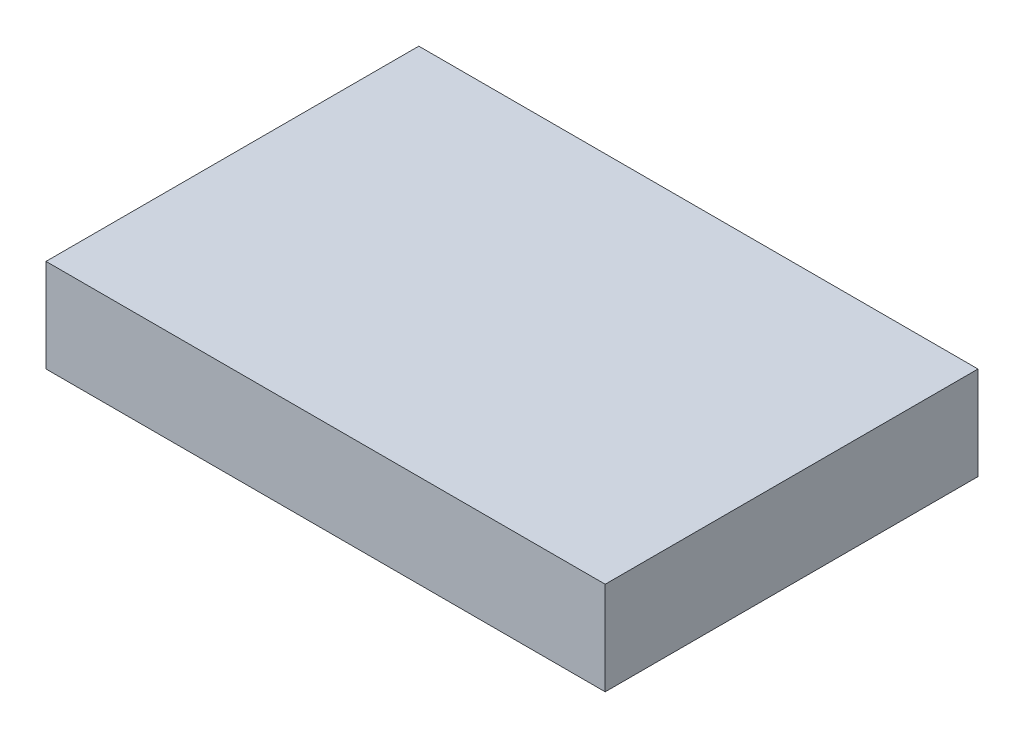
ISO-10303-21;
HEADER;
FILE_DESCRIPTION(('STEP AP214'),'2;1');
FILE_NAME('part.step','',(''),(''),'','','');
FILE_SCHEMA(('AUTOMOTIVE_DESIGN { 1 0 10303 214 1 1 1 1 }'));
ENDSEC;
DATA;
#1=APPLICATION_CONTEXT('core data for automotive mechanical design processes');
#2=APPLICATION_PROTOCOL_DEFINITION('international standard','automotive_design',2000,#1);
#3=PRODUCT_CONTEXT('',#1,'mechanical');
#4=PRODUCT('Part','Part','',(#3));
#5=PRODUCT_RELATED_PRODUCT_CATEGORY('part','',(#4));
#6=PRODUCT_DEFINITION_FORMATION('','',#4);
#7=PRODUCT_DEFINITION_CONTEXT('part definition',#1,'design');
#8=PRODUCT_DEFINITION('design','',#6,#7);
#9=PRODUCT_DEFINITION_SHAPE('','',#8);
#10=(LENGTH_UNIT() NAMED_UNIT(*) SI_UNIT(.MILLI.,.METRE.));
#11=(NAMED_UNIT(*) PLANE_ANGLE_UNIT() SI_UNIT($,.RADIAN.));
#12=(NAMED_UNIT(*) SI_UNIT($,.STERADIAN.) SOLID_ANGLE_UNIT());
#13=UNCERTAINTY_MEASURE_WITH_UNIT(LENGTH_MEASURE(1.E-05),#10,'distance_accuracy_value','');
#14=(GEOMETRIC_REPRESENTATION_CONTEXT(3) GLOBAL_UNCERTAINTY_ASSIGNED_CONTEXT((#13)) GLOBAL_UNIT_ASSIGNED_CONTEXT((#10,
#11,#12)) REPRESENTATION_CONTEXT('',''));
#15=CARTESIAN_POINT('',(0.,0.,0.));
#16=DIRECTION('',(0.,0.,1.));
#17=DIRECTION('',(1.,0.,0.));
#18=AXIS2_PLACEMENT_3D('',#15,#16,#17);
#19=CARTESIAN_POINT('',(-1.05796274183729,5.66960732929227,43.6610122279492));
#20=DIRECTION('',(0.,1.,0.));
#21=DIRECTION('',(1.,0.,0.));
#22=AXIS2_PLACEMENT_3D('',#19,#20,#21);
#23=PLANE('',#22);
#24=DIRECTION('',(1.,0.,0.));
#25=VECTOR('',#24,1.);
#26=CARTESIAN_POINT('',(-7.0579627418373,5.66960732929227,39.6610122279492));
#27=LINE('',#26,#25);
#28=CARTESIAN_POINT('',(-7.0579627418373,5.66960732929227,39.6610122279492));
#29=VERTEX_POINT('',#28);
#30=CARTESIAN_POINT('',(4.9420372581627,5.66960732929227,39.6610122279492));
#31=VERTEX_POINT('',#30);
#32=EDGE_CURVE('E58',#29,#31,#27,.T.);
#33=ORIENTED_EDGE('',*,*,#32,.T.);
#34=DIRECTION('',(0.,0.,1.));
#35=VECTOR('',#34,1.);
#36=CARTESIAN_POINT('',(4.9420372581627,5.66960732929227,39.6610122279492));
#37=LINE('',#36,#35);
#38=CARTESIAN_POINT('',(4.94203725816271,5.66960732929227,47.6610122279492));
#39=VERTEX_POINT('',#38);
#40=EDGE_CURVE('E20',#31,#39,#37,.T.);
#41=ORIENTED_EDGE('',*,*,#40,.T.);
#42=DIRECTION('',(-1.,0.,0.));
#43=VECTOR('',#42,1.);
#44=CARTESIAN_POINT('',(-7.0579627418373,5.66960732929227,47.6610122279492));
#45=LINE('',#44,#43);
#46=CARTESIAN_POINT('',(-7.0579627418373,5.66960732929227,47.6610122279492));
#47=VERTEX_POINT('',#46);
#48=EDGE_CURVE('E89',#39,#47,#45,.T.);
#49=ORIENTED_EDGE('',*,*,#48,.T.);
#50=DIRECTION('',(0.,0.,-1.));
#51=VECTOR('',#50,1.);
#52=CARTESIAN_POINT('',(-7.0579627418373,5.66960732929227,39.6610122279492));
#53=LINE('',#52,#51);
#54=EDGE_CURVE('E56',#47,#29,#53,.T.);
#55=ORIENTED_EDGE('',*,*,#54,.T.);
#56=EDGE_LOOP('',(#33,#41,#49,#55));
#57=FACE_BOUND('',#56,.T.);
#58=ADVANCED_FACE('F17',(#57),#23,.F.);
#59=CARTESIAN_POINT('',(4.9420372581627,7.66960732929227,39.6610122279492));
#60=DIRECTION('',(-1.,0.,0.));
#61=DIRECTION('',(0.,0.,1.));
#62=AXIS2_PLACEMENT_3D('',#59,#60,#61);
#63=PLANE('',#62);
#64=DIRECTION('',(0.,1.,0.));
#65=VECTOR('',#64,1.);
#66=CARTESIAN_POINT('',(4.94203725816271,7.66960732929227,47.6610122279492));
#67=LINE('',#66,#65);
#68=CARTESIAN_POINT('',(4.94203725816271,7.66960732929227,47.6610122279492));
#69=VERTEX_POINT('',#68);
#70=EDGE_CURVE('E70',#69,#39,#67,.F.);
#71=ORIENTED_EDGE('',*,*,#70,.T.);
#72=ORIENTED_EDGE('',*,*,#40,.F.);
#73=DIRECTION('',(0.,-1.,0.));
#74=VECTOR('',#73,1.);
#75=CARTESIAN_POINT('',(4.94203725816271,7.66960732929227,39.6610122279492));
#76=LINE('',#75,#74);
#77=CARTESIAN_POINT('',(4.9420372581627,7.66960732929227,39.6610122279492));
#78=VERTEX_POINT('',#77);
#79=EDGE_CURVE('E65',#31,#78,#76,.F.);
#80=ORIENTED_EDGE('',*,*,#79,.T.);
#81=DIRECTION('',(0.,0.,-1.));
#82=VECTOR('',#81,1.);
#83=CARTESIAN_POINT('',(4.94203725816271,7.66960732929227,43.6610122279492));
#84=LINE('',#83,#82);
#85=EDGE_CURVE('E94',#69,#78,#84,.T.);
#86=ORIENTED_EDGE('',*,*,#85,.F.);
#87=EDGE_LOOP('',(#71,#72,#80,#86));
#88=FACE_BOUND('',#87,.T.);
#89=ADVANCED_FACE('F67',(#88),#63,.F.);
#90=CARTESIAN_POINT('',(-7.0579627418373,7.66960732929227,39.6610122279492));
#91=DIRECTION('',(0.,0.,1.));
#92=DIRECTION('',(0.,-1.,0.));
#93=AXIS2_PLACEMENT_3D('',#90,#91,#92);
#94=PLANE('',#93);
#95=ORIENTED_EDGE('',*,*,#79,.F.);
#96=ORIENTED_EDGE('',*,*,#32,.F.);
#97=DIRECTION('',(0.,1.,0.));
#98=VECTOR('',#97,1.);
#99=CARTESIAN_POINT('',(-7.0579627418373,7.66960732929227,39.6610122279492));
#100=LINE('',#99,#98);
#101=CARTESIAN_POINT('',(-7.0579627418373,7.66960732929227,39.6610122279492));
#102=VERTEX_POINT('',#101);
#103=EDGE_CURVE('E82',#29,#102,#100,.T.);
#104=ORIENTED_EDGE('',*,*,#103,.T.);
#105=DIRECTION('',(1.,0.,0.));
#106=VECTOR('',#105,1.);
#107=CARTESIAN_POINT('',(-1.05796274183729,7.66960732929227,39.6610122279492));
#108=LINE('',#107,#106);
#109=EDGE_CURVE('E75',#78,#102,#108,.F.);
#110=ORIENTED_EDGE('',*,*,#109,.F.);
#111=EDGE_LOOP('',(#95,#96,#104,#110));
#112=FACE_BOUND('',#111,.T.);
#113=ADVANCED_FACE('F73',(#112),#94,.F.);
#114=CARTESIAN_POINT('',(-7.0579627418373,7.66960732929227,39.6610122279492));
#115=DIRECTION('',(1.,0.,0.));
#116=DIRECTION('',(0.,0.,-1.));
#117=AXIS2_PLACEMENT_3D('',#114,#115,#116);
#118=PLANE('',#117);
#119=ORIENTED_EDGE('',*,*,#103,.F.);
#120=ORIENTED_EDGE('',*,*,#54,.F.);
#121=DIRECTION('',(0.,1.,0.));
#122=VECTOR('',#121,1.);
#123=CARTESIAN_POINT('',(-7.0579627418373,7.66960732929227,47.6610122279492));
#124=LINE('',#123,#122);
#125=CARTESIAN_POINT('',(-7.0579627418373,7.66960732929227,47.6610122279492));
#126=VERTEX_POINT('',#125);
#127=EDGE_CURVE('E36',#47,#126,#124,.T.);
#128=ORIENTED_EDGE('',*,*,#127,.T.);
#129=DIRECTION('',(0.,0.,-1.));
#130=VECTOR('',#129,1.);
#131=CARTESIAN_POINT('',(-7.0579627418373,7.66960732929227,43.6610122279492));
#132=LINE('',#131,#130);
#133=EDGE_CURVE('E27',#102,#126,#132,.F.);
#134=ORIENTED_EDGE('',*,*,#133,.F.);
#135=EDGE_LOOP('',(#119,#120,#128,#134));
#136=FACE_BOUND('',#135,.T.);
#137=ADVANCED_FACE('F102',(#136),#118,.F.);
#138=CARTESIAN_POINT('',(-7.0579627418373,7.66960732929227,47.6610122279492));
#139=DIRECTION('',(0.,0.,-1.));
#140=DIRECTION('',(-1.,0.,0.));
#141=AXIS2_PLACEMENT_3D('',#138,#139,#140);
#142=PLANE('',#141);
#143=ORIENTED_EDGE('',*,*,#127,.F.);
#144=ORIENTED_EDGE('',*,*,#48,.F.);
#145=ORIENTED_EDGE('',*,*,#70,.F.);
#146=DIRECTION('',(1.,0.,0.));
#147=VECTOR('',#146,1.);
#148=CARTESIAN_POINT('',(-1.05796274183729,7.66960732929227,47.6610122279492));
#149=LINE('',#148,#147);
#150=EDGE_CURVE('E11',#126,#69,#149,.T.);
#151=ORIENTED_EDGE('',*,*,#150,.F.);
#152=EDGE_LOOP('',(#143,#144,#145,#151));
#153=FACE_BOUND('',#152,.T.);
#154=ADVANCED_FACE('F104',(#153),#142,.F.);
#155=CARTESIAN_POINT('',(-1.05796274183729,7.66960732929227,43.6610122279492));
#156=DIRECTION('',(0.,1.,0.));
#157=DIRECTION('',(1.,0.,0.));
#158=AXIS2_PLACEMENT_3D('',#155,#156,#157);
#159=PLANE('',#158);
#160=ORIENTED_EDGE('',*,*,#133,.T.);
#161=ORIENTED_EDGE('',*,*,#150,.T.);
#162=ORIENTED_EDGE('',*,*,#85,.T.);
#163=ORIENTED_EDGE('',*,*,#109,.T.);
#164=EDGE_LOOP('',(#160,#161,#162,#163));
#165=FACE_BOUND('',#164,.T.);
#166=ADVANCED_FACE('F101',(#165),#159,.T.);
#167=CLOSED_SHELL('',(#58,#89,#113,#137,#154,#166));
#168=MANIFOLD_SOLID_BREP('B1',#167);
#169=ADVANCED_BREP_SHAPE_REPRESENTATION('',(#18,#168),#14);
#170=SHAPE_DEFINITION_REPRESENTATION(#9,#169);
ENDSEC;
END-ISO-10303-21;
